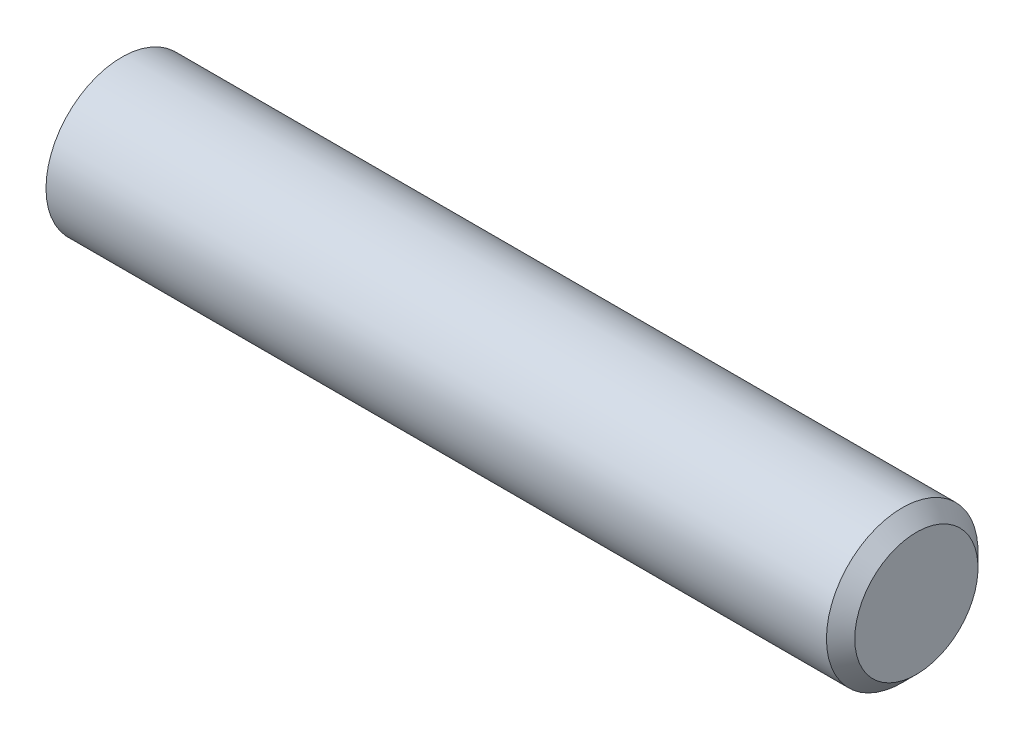
ISO-10303-21;
HEADER;
FILE_DESCRIPTION(('STEP AP214'),'2;1');
FILE_NAME('part.step','',(''),(''),'','','');
FILE_SCHEMA(('AUTOMOTIVE_DESIGN { 1 0 10303 214 1 1 1 1 }'));
ENDSEC;
DATA;
#1=APPLICATION_CONTEXT('core data for automotive mechanical design processes');
#2=APPLICATION_PROTOCOL_DEFINITION('international standard','automotive_design',2000,#1);
#3=PRODUCT_CONTEXT('',#1,'mechanical');
#4=PRODUCT('Part','Part','',(#3));
#5=PRODUCT_RELATED_PRODUCT_CATEGORY('part','',(#4));
#6=PRODUCT_DEFINITION_FORMATION('','',#4);
#7=PRODUCT_DEFINITION_CONTEXT('part definition',#1,'design');
#8=PRODUCT_DEFINITION('design','',#6,#7);
#9=PRODUCT_DEFINITION_SHAPE('','',#8);
#10=(LENGTH_UNIT() NAMED_UNIT(*) SI_UNIT(.MILLI.,.METRE.));
#11=(NAMED_UNIT(*) PLANE_ANGLE_UNIT() SI_UNIT($,.RADIAN.));
#12=(NAMED_UNIT(*) SI_UNIT($,.STERADIAN.) SOLID_ANGLE_UNIT());
#13=UNCERTAINTY_MEASURE_WITH_UNIT(LENGTH_MEASURE(1.E-05),#10,'distance_accuracy_value','');
#14=(GEOMETRIC_REPRESENTATION_CONTEXT(3) GLOBAL_UNCERTAINTY_ASSIGNED_CONTEXT((#13)) GLOBAL_UNIT_ASSIGNED_CONTEXT((#10,
#11,#12)) REPRESENTATION_CONTEXT('',''));
#15=CARTESIAN_POINT('',(0.,0.,0.));
#16=DIRECTION('',(0.,0.,1.));
#17=DIRECTION('',(1.,0.,0.));
#18=AXIS2_PLACEMENT_3D('',#15,#16,#17);
#19=CARTESIAN_POINT('',(-31.75,0.,0.));
#20=DIRECTION('',(-1.,0.,0.));
#21=DIRECTION('',(0.,0.,1.));
#22=AXIS2_PLACEMENT_3D('',#19,#20,#21);
#23=CYLINDRICAL_SURFACE('',#22,1.5);
#24=CARTESIAN_POINT('',(17.2711878155306,0.,0.));
#25=DIRECTION('',(-1.,0.,0.));
#26=DIRECTION('',(0.,0.,1.));
#27=AXIS2_PLACEMENT_3D('',#24,#25,#26);
#28=CIRCLE('',#27,1.5);
#29=CARTESIAN_POINT('',(17.2711878155306,0.,1.5));
#30=VERTEX_POINT('',#29);
#31=EDGE_CURVE('E19',#30,#30,#28,.T.);
#32=ORIENTED_EDGE('',*,*,#31,.F.);
#33=EDGE_LOOP('',(#32));
#34=FACE_BOUND('',#33,.T.);
#35=CARTESIAN_POINT('',(32.7195,0.,0.));
#36=DIRECTION('',(-1.,0.,0.));
#37=DIRECTION('',(0.,0.,1.));
#38=AXIS2_PLACEMENT_3D('',#35,#36,#37);
#39=CIRCLE('',#38,1.5);
#40=CARTESIAN_POINT('',(32.7195,0.,1.5));
#41=VERTEX_POINT('',#40);
#42=EDGE_CURVE('E11',#41,#41,#39,.T.);
#43=ORIENTED_EDGE('',*,*,#42,.T.);
#44=EDGE_LOOP('',(#43));
#45=FACE_BOUND('',#44,.T.);
#46=ADVANCED_FACE('F16',(#34,#45),#23,.T.);
#47=CARTESIAN_POINT('',(33.,0.,0.));
#48=DIRECTION('',(-1.,0.,0.));
#49=DIRECTION('',(0.,0.,1.));
#50=AXIS2_PLACEMENT_3D('',#47,#48,#49);
#51=CONICAL_SURFACE('',#50,1.2195,0.78539816339747);
#52=ORIENTED_EDGE('',*,*,#42,.F.);
#53=EDGE_LOOP('',(#52));
#54=FACE_BOUND('',#53,.T.);
#55=CARTESIAN_POINT('',(33.,0.,0.));
#56=DIRECTION('',(-1.,0.,0.));
#57=DIRECTION('',(0.,0.,1.));
#58=AXIS2_PLACEMENT_3D('',#55,#56,#57);
#59=CIRCLE('',#58,1.2195);
#60=CARTESIAN_POINT('',(33.,0.,1.2195));
#61=VERTEX_POINT('',#60);
#62=EDGE_CURVE('E23',#61,#61,#59,.T.);
#63=ORIENTED_EDGE('',*,*,#62,.T.);
#64=EDGE_LOOP('',(#63));
#65=FACE_BOUND('',#64,.T.);
#66=ADVANCED_FACE('F36',(#54,#65),#51,.T.);
#67=CARTESIAN_POINT('',(33.,1.2195,0.));
#68=DIRECTION('',(1.,0.,0.));
#69=DIRECTION('',(0.,0.,-1.));
#70=AXIS2_PLACEMENT_3D('',#67,#68,#69);
#71=PLANE('',#70);
#72=ORIENTED_EDGE('',*,*,#62,.F.);
#73=EDGE_LOOP('',(#72));
#74=FACE_BOUND('',#73,.T.);
#75=ADVANCED_FACE('F28',(#74),#71,.T.);
#76=CARTESIAN_POINT('',(12.573,0.,0.));
#77=DIRECTION('',(-1.,0.,0.));
#78=DIRECTION('',(0.,0.,1.));
#79=AXIS2_PLACEMENT_3D('',#76,#77,#78);
#80=CONICAL_SURFACE('',#79,9.6375,1.0471975511966);
#81=ORIENTED_EDGE('',*,*,#31,.T.);
#82=EDGE_LOOP('',(#81));
#83=FACE_BOUND('',#82,.T.);
#84=CARTESIAN_POINT('',(18.1372132193151,0.,0.));
#85=VERTEX_POINT('',#84);
#86=VERTEX_LOOP('',#85);
#87=FACE_BOUND('',#86,.T.);
#88=ADVANCED_FACE('F26',(#83,#87),#80,.F.);
#89=CLOSED_SHELL('',(#46,#66,#75,#88));
#90=MANIFOLD_SOLID_BREP('B1',#89);
#91=ADVANCED_BREP_SHAPE_REPRESENTATION('',(#18,#90),#14);
#92=SHAPE_DEFINITION_REPRESENTATION(#9,#91);
ENDSEC;
END-ISO-10303-21;
